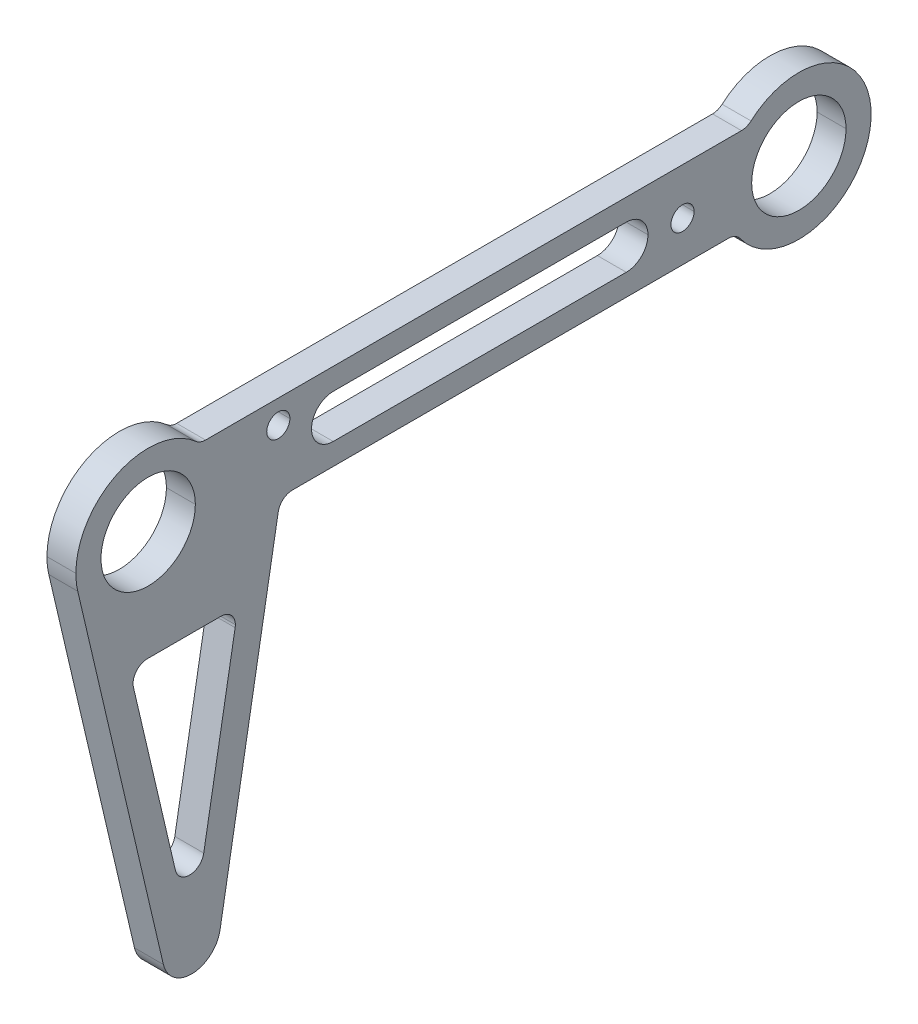
ISO-10303-21;
HEADER;
FILE_DESCRIPTION(('STEP AP214'),'2;1');
FILE_NAME('part.step','',(''),(''),'','','');
FILE_SCHEMA(('AUTOMOTIVE_DESIGN { 1 0 10303 214 1 1 1 1 }'));
ENDSEC;
DATA;
#1=APPLICATION_CONTEXT('core data for automotive mechanical design processes');
#2=APPLICATION_PROTOCOL_DEFINITION('international standard','automotive_design',2000,#1);
#3=PRODUCT_CONTEXT('',#1,'mechanical');
#4=PRODUCT('Part','Part','',(#3));
#5=PRODUCT_RELATED_PRODUCT_CATEGORY('part','',(#4));
#6=PRODUCT_DEFINITION_FORMATION('','',#4);
#7=PRODUCT_DEFINITION_CONTEXT('part definition',#1,'design');
#8=PRODUCT_DEFINITION('design','',#6,#7);
#9=PRODUCT_DEFINITION_SHAPE('','',#8);
#10=(LENGTH_UNIT() NAMED_UNIT(*) SI_UNIT(.MILLI.,.METRE.));
#11=(NAMED_UNIT(*) PLANE_ANGLE_UNIT() SI_UNIT($,.RADIAN.));
#12=(NAMED_UNIT(*) SI_UNIT($,.STERADIAN.) SOLID_ANGLE_UNIT());
#13=UNCERTAINTY_MEASURE_WITH_UNIT(LENGTH_MEASURE(1.E-05),#10,'distance_accuracy_value','');
#14=(GEOMETRIC_REPRESENTATION_CONTEXT(3) GLOBAL_UNCERTAINTY_ASSIGNED_CONTEXT((#13)) GLOBAL_UNIT_ASSIGNED_CONTEXT((#10,
#11,#12)) REPRESENTATION_CONTEXT('',''));
#15=CARTESIAN_POINT('',(0.,0.,0.));
#16=DIRECTION('',(0.,0.,1.));
#17=DIRECTION('',(1.,0.,0.));
#18=AXIS2_PLACEMENT_3D('',#15,#16,#17);
#19=CARTESIAN_POINT('',(-6.,-2.,-25.5960877099638));
#20=DIRECTION('',(0.,-1.,0.));
#21=DIRECTION('',(0.,0.,-1.));
#22=AXIS2_PLACEMENT_3D('',#19,#20,#21);
#23=PLANE('',#22);
#24=DIRECTION('',(1.,0.,0.));
#25=VECTOR('',#24,1.);
#26=CARTESIAN_POINT('',(-6.,-2.,-25.5960877099638));
#27=LINE('',#26,#25);
#28=CARTESIAN_POINT('',(0.,-2.,-25.5960877099638));
#29=VERTEX_POINT('',#28);
#30=CARTESIAN_POINT('',(4.,-2.,-25.5960877099638));
#31=VERTEX_POINT('',#30);
#32=EDGE_CURVE('E25',#29,#31,#27,.T.);
#33=ORIENTED_EDGE('',*,*,#32,.T.);
#34=DIRECTION('',(0.,0.,-1.));
#35=VECTOR('',#34,1.);
#36=CARTESIAN_POINT('',(4.,-2.,-25.5960877099638));
#37=LINE('',#36,#35);
#38=CARTESIAN_POINT('',(4.,-2.,-66.128704493595));
#39=VERTEX_POINT('',#38);
#40=EDGE_CURVE('E414',#31,#39,#37,.T.);
#41=ORIENTED_EDGE('',*,*,#40,.T.);
#42=DIRECTION('',(1.,0.,0.));
#43=VECTOR('',#42,1.);
#44=CARTESIAN_POINT('',(-6.,-2.,-66.128704493595));
#45=LINE('',#44,#43);
#46=CARTESIAN_POINT('',(0.,-2.,-66.128704493595));
#47=VERTEX_POINT('',#46);
#48=EDGE_CURVE('E11',#47,#39,#45,.T.);
#49=ORIENTED_EDGE('',*,*,#48,.F.);
#50=DIRECTION('',(0.,0.,-1.));
#51=VECTOR('',#50,1.);
#52=CARTESIAN_POINT('',(0.,-2.,0.));
#53=LINE('',#52,#51);
#54=EDGE_CURVE('E418',#29,#47,#53,.T.);
#55=ORIENTED_EDGE('',*,*,#54,.F.);
#56=EDGE_LOOP('',(#33,#41,#49,#55));
#57=FACE_BOUND('',#56,.T.);
#58=ADVANCED_FACE('F17',(#57),#23,.F.);
#59=CARTESIAN_POINT('',(-6.,1.,-66.128704493595));
#60=DIRECTION('',(1.,0.,0.));
#61=DIRECTION('',(0.,0.,-1.));
#62=AXIS2_PLACEMENT_3D('',#59,#60,#61);
#63=CYLINDRICAL_SURFACE('',#62,3.);
#64=DIRECTION('',(1.,0.,0.));
#65=VECTOR('',#64,1.);
#66=CARTESIAN_POINT('',(-6.,1.,-69.128704493595));
#67=LINE('',#66,#65);
#68=CARTESIAN_POINT('',(0.,1.,-69.128704493595));
#69=VERTEX_POINT('',#68);
#70=CARTESIAN_POINT('',(4.,1.,-69.128704493595));
#71=VERTEX_POINT('',#70);
#72=EDGE_CURVE('E1470',#69,#71,#67,.T.);
#73=ORIENTED_EDGE('',*,*,#72,.F.);
#74=CARTESIAN_POINT('',(0.,1.,-66.128704493595));
#75=DIRECTION('',(1.,0.,0.));
#76=DIRECTION('',(0.,0.,-1.));
#77=AXIS2_PLACEMENT_3D('',#74,#75,#76);
#78=CIRCLE('',#77,3.);
#79=EDGE_CURVE('E422',#47,#69,#78,.T.);
#80=ORIENTED_EDGE('',*,*,#79,.F.);
#81=ORIENTED_EDGE('',*,*,#48,.T.);
#82=CARTESIAN_POINT('',(4.,1.,-66.128704493595));
#83=DIRECTION('',(1.,0.,0.));
#84=DIRECTION('',(0.,0.,-1.));
#85=AXIS2_PLACEMENT_3D('',#82,#83,#84);
#86=CIRCLE('',#85,3.);
#87=EDGE_CURVE('E362',#39,#71,#86,.T.);
#88=ORIENTED_EDGE('',*,*,#87,.T.);
#89=EDGE_LOOP('',(#73,#80,#81,#88));
#90=FACE_BOUND('',#89,.T.);
#91=ADVANCED_FACE('F1087',(#90),#63,.F.);
#92=CARTESIAN_POINT('',(-6.,4.,-25.5960877099638));
#93=DIRECTION('',(0.,1.,0.));
#94=DIRECTION('',(1.,0.,0.));
#95=AXIS2_PLACEMENT_3D('',#92,#93,#94);
#96=PLANE('',#95);
#97=DIRECTION('',(1.,0.,0.));
#98=VECTOR('',#97,1.);
#99=CARTESIAN_POINT('',(-6.,4.,-66.128704493595));
#100=LINE('',#99,#98);
#101=CARTESIAN_POINT('',(0.,4.,-66.128704493595));
#102=VERTEX_POINT('',#101);
#103=CARTESIAN_POINT('',(4.,4.,-66.128704493595));
#104=VERTEX_POINT('',#103);
#105=EDGE_CURVE('E1482',#102,#104,#100,.T.);
#106=ORIENTED_EDGE('',*,*,#105,.T.);
#107=DIRECTION('',(0.,0.,1.));
#108=VECTOR('',#107,1.);
#109=CARTESIAN_POINT('',(4.,4.,-25.5960877099638));
#110=LINE('',#109,#108);
#111=CARTESIAN_POINT('',(4.,4.,-25.5960877099638));
#112=VERTEX_POINT('',#111);
#113=EDGE_CURVE('E358',#104,#112,#110,.T.);
#114=ORIENTED_EDGE('',*,*,#113,.T.);
#115=DIRECTION('',(1.,0.,0.));
#116=VECTOR('',#115,1.);
#117=CARTESIAN_POINT('',(-6.,4.,-25.5960877099638));
#118=LINE('',#117,#116);
#119=CARTESIAN_POINT('',(0.,4.,-25.5960877099638));
#120=VERTEX_POINT('',#119);
#121=EDGE_CURVE('E523',#120,#112,#118,.T.);
#122=ORIENTED_EDGE('',*,*,#121,.F.);
#123=DIRECTION('',(0.,0.,1.));
#124=VECTOR('',#123,1.);
#125=CARTESIAN_POINT('',(0.,4.,0.));
#126=LINE('',#125,#124);
#127=EDGE_CURVE('E312',#102,#120,#126,.T.);
#128=ORIENTED_EDGE('',*,*,#127,.F.);
#129=EDGE_LOOP('',(#106,#114,#122,#128));
#130=FACE_BOUND('',#129,.T.);
#131=ADVANCED_FACE('F864',(#130),#96,.F.);
#132=CARTESIAN_POINT('',(-6.,1.,-25.5960877099638));
#133=DIRECTION('',(1.,0.,0.));
#134=DIRECTION('',(0.,0.,-1.));
#135=AXIS2_PLACEMENT_3D('',#132,#133,#134);
#136=CYLINDRICAL_SURFACE('',#135,3.);
#137=ORIENTED_EDGE('',*,*,#121,.T.);
#138=CARTESIAN_POINT('',(4.,1.,-25.5960877099638));
#139=DIRECTION('',(1.,0.,0.));
#140=DIRECTION('',(0.,0.,-1.));
#141=AXIS2_PLACEMENT_3D('',#138,#139,#140);
#142=CIRCLE('',#141,3.);
#143=EDGE_CURVE('E363',#112,#31,#142,.T.);
#144=ORIENTED_EDGE('',*,*,#143,.T.);
#145=ORIENTED_EDGE('',*,*,#32,.F.);
#146=CARTESIAN_POINT('',(0.,1.,-25.5960877099638));
#147=DIRECTION('',(1.,0.,0.));
#148=DIRECTION('',(0.,0.,-1.));
#149=AXIS2_PLACEMENT_3D('',#146,#147,#148);
#150=CIRCLE('',#149,3.);
#151=EDGE_CURVE('E423',#120,#29,#150,.T.);
#152=ORIENTED_EDGE('',*,*,#151,.F.);
#153=EDGE_LOOP('',(#137,#144,#145,#152));
#154=FACE_BOUND('',#153,.T.);
#155=ADVANCED_FACE('F860',(#154),#136,.F.);
#156=CARTESIAN_POINT('',(4.,-7.,-19.9579703985189));
#157=DIRECTION('',(1.,0.,0.));
#158=DIRECTION('',(0.,0.,-1.));
#159=AXIS2_PLACEMENT_3D('',#156,#157,#158);
#160=CYLINDRICAL_SURFACE('',#159,2.);
#161=CARTESIAN_POINT('',(0.,-7.,-19.9579703985189));
#162=DIRECTION('',(1.,0.,0.));
#163=DIRECTION('',(0.,0.,-1.));
#164=AXIS2_PLACEMENT_3D('',#161,#162,#163);
#165=CIRCLE('',#164,2.);
#166=CARTESIAN_POINT('',(0.,-5.,-19.9579703985189));
#167=VERTEX_POINT('',#166);
#168=CARTESIAN_POINT('',(0.,-6.65558033936127,-17.9878498191214));
#169=VERTEX_POINT('',#168);
#170=EDGE_CURVE('E451',#167,#169,#165,.T.);
#171=ORIENTED_EDGE('',*,*,#170,.F.);
#172=DIRECTION('',(-1.,0.,0.));
#173=VECTOR('',#172,1.);
#174=CARTESIAN_POINT('',(-6.,-5.,-19.9579703985189));
#175=LINE('',#174,#173);
#176=CARTESIAN_POINT('',(4.,-5.,-19.9579703985189));
#177=VERTEX_POINT('',#176);
#178=EDGE_CURVE('E377',#177,#167,#175,.T.);
#179=ORIENTED_EDGE('',*,*,#178,.F.);
#180=CARTESIAN_POINT('',(4.,-7.,-19.9579703985189));
#181=DIRECTION('',(-1.,0.,0.));
#182=DIRECTION('',(0.,0.,-1.));
#183=AXIS2_PLACEMENT_3D('',#180,#181,#182);
#184=CIRCLE('',#183,2.);
#185=CARTESIAN_POINT('',(4.,-6.65558033936127,-17.9878498191214));
#186=VERTEX_POINT('',#185);
#187=EDGE_CURVE('E390',#186,#177,#184,.T.);
#188=ORIENTED_EDGE('',*,*,#187,.F.);
#189=DIRECTION('',(1.,0.,0.));
#190=VECTOR('',#189,1.);
#191=CARTESIAN_POINT('',(4.,-6.65558033936127,-17.9878498191214));
#192=LINE('',#191,#190);
#193=EDGE_CURVE('E505',#169,#186,#192,.T.);
#194=ORIENTED_EDGE('',*,*,#193,.F.);
#195=EDGE_LOOP('',(#171,#179,#188,#194));
#196=FACE_BOUND('',#195,.T.);
#197=ADVANCED_FACE('F652',(#196),#160,.F.);
#198=CARTESIAN_POINT('',(4.,-17.1742889234771,-10.0579544592766));
#199=DIRECTION('',(1.,0.,0.));
#200=DIRECTION('',(0.,0.,-1.));
#201=AXIS2_PLACEMENT_3D('',#198,#199,#200);
#202=CYLINDRICAL_SURFACE('',#201,2.);
#203=DIRECTION('',(1.,0.,0.));
#204=VECTOR('',#203,1.);
#205=CARTESIAN_POINT('',(4.,-17.1742889234771,-12.0579544592766));
#206=LINE('',#205,#204);
#207=CARTESIAN_POINT('',(0.,-17.1742889234771,-12.0579544592766));
#208=VERTEX_POINT('',#207);
#209=CARTESIAN_POINT('',(4.,-17.1742889234771,-12.0579544592766));
#210=VERTEX_POINT('',#209);
#211=EDGE_CURVE('E1509',#208,#210,#206,.T.);
#212=ORIENTED_EDGE('',*,*,#211,.F.);
#213=CARTESIAN_POINT('',(0.,-17.1742889234771,-10.0579544592766));
#214=DIRECTION('',(1.,0.,0.));
#215=DIRECTION('',(0.,0.,-1.));
#216=AXIS2_PLACEMENT_3D('',#213,#214,#215);
#217=CIRCLE('',#216,2.);
#218=CARTESIAN_POINT('',(0.,-17.5187085841158,-12.0280750386741));
#219=VERTEX_POINT('',#218);
#220=EDGE_CURVE('E399',#219,#208,#217,.T.);
#221=ORIENTED_EDGE('',*,*,#220,.F.);
#222=DIRECTION('',(-1.,0.,0.));
#223=VECTOR('',#222,1.);
#224=CARTESIAN_POINT('',(0.,-17.5187085841158,-12.0280750386741));
#225=LINE('',#224,#223);
#226=CARTESIAN_POINT('',(4.,-17.5187085841158,-12.0280750386741));
#227=VERTEX_POINT('',#226);
#228=EDGE_CURVE('E475',#227,#219,#225,.T.);
#229=ORIENTED_EDGE('',*,*,#228,.F.);
#230=CARTESIAN_POINT('',(4.,-17.1742889234771,-10.0579544592766));
#231=DIRECTION('',(-1.,0.,0.));
#232=DIRECTION('',(0.,0.,-1.));
#233=AXIS2_PLACEMENT_3D('',#230,#231,#232);
#234=CIRCLE('',#233,2.);
#235=EDGE_CURVE('E353',#210,#227,#234,.T.);
#236=ORIENTED_EDGE('',*,*,#235,.F.);
#237=EDGE_LOOP('',(#212,#221,#229,#236));
#238=FACE_BOUND('',#237,.T.);
#239=ADVANCED_FACE('F1064',(#238),#202,.F.);
#240=CARTESIAN_POINT('',(4.,-17.1742889234771,0.0911708065031039));
#241=DIRECTION('',(1.,0.,0.));
#242=DIRECTION('',(0.,0.,-1.));
#243=AXIS2_PLACEMENT_3D('',#240,#241,#242);
#244=CYLINDRICAL_SURFACE('',#243,2.);
#245=CARTESIAN_POINT('',(4.,-17.1742889234771,0.0911708065031039));
#246=DIRECTION('',(-1.,0.,0.));
#247=DIRECTION('',(0.,0.,-1.));
#248=AXIS2_PLACEMENT_3D('',#245,#246,#247);
#249=CIRCLE('',#248,2.);
#250=CARTESIAN_POINT('',(4.,-17.6297633760318,2.03861606197755));
#251=VERTEX_POINT('',#250);
#252=CARTESIAN_POINT('',(4.,-15.1742889234772,0.0911708065031037));
#253=VERTEX_POINT('',#252);
#254=EDGE_CURVE('E441',#251,#253,#249,.T.);
#255=ORIENTED_EDGE('',*,*,#254,.F.);
#256=DIRECTION('',(1.,0.,0.));
#257=VECTOR('',#256,1.);
#258=CARTESIAN_POINT('',(4.,-17.6297633760319,2.03861606197755));
#259=LINE('',#258,#257);
#260=CARTESIAN_POINT('',(0.,-17.6297633760318,2.03861606197755));
#261=VERTEX_POINT('',#260);
#262=EDGE_CURVE('E49',#261,#251,#259,.T.);
#263=ORIENTED_EDGE('',*,*,#262,.F.);
#264=CARTESIAN_POINT('',(0.,-17.1742889234771,0.0911708065031039));
#265=DIRECTION('',(1.,0.,0.));
#266=DIRECTION('',(0.,0.,-1.));
#267=AXIS2_PLACEMENT_3D('',#264,#265,#266);
#268=CIRCLE('',#267,2.);
#269=CARTESIAN_POINT('',(0.,-15.1742889234772,0.0911708065031037));
#270=VERTEX_POINT('',#269);
#271=EDGE_CURVE('E482',#270,#261,#268,.T.);
#272=ORIENTED_EDGE('',*,*,#271,.F.);
#273=DIRECTION('',(-1.,0.,0.));
#274=VECTOR('',#273,1.);
#275=CARTESIAN_POINT('',(0.,-15.1742889234772,0.0911708065031037));
#276=LINE('',#275,#274);
#277=EDGE_CURVE('E508',#253,#270,#276,.T.);
#278=ORIENTED_EDGE('',*,*,#277,.F.);
#279=EDGE_LOOP('',(#255,#263,#272,#278));
#280=FACE_BOUND('',#279,.T.);
#281=ADVANCED_FACE('F1055',(#280),#244,.F.);
#282=CARTESIAN_POINT('',(4.,-42.0067068883339,-5.71671105634195));
#283=DIRECTION('',(1.,0.,0.));
#284=DIRECTION('',(0.,0.,-1.));
#285=AXIS2_PLACEMENT_3D('',#282,#283,#284);
#286=CYLINDRICAL_SURFACE('',#285,2.);
#287=CARTESIAN_POINT('',(4.,-42.0067068883339,-5.71671105634195));
#288=DIRECTION('',(-1.,0.,0.));
#289=DIRECTION('',(0.,0.,-1.));
#290=AXIS2_PLACEMENT_3D('',#287,#288,#289);
#291=CIRCLE('',#290,2.);
#292=CARTESIAN_POINT('',(4.,-42.3511265489726,-7.68683163573943));
#293=VERTEX_POINT('',#292);
#294=CARTESIAN_POINT('',(4.,-42.4621813408885,-3.7692658008675));
#295=VERTEX_POINT('',#294);
#296=EDGE_CURVE('E431',#293,#295,#291,.T.);
#297=ORIENTED_EDGE('',*,*,#296,.F.);
#298=DIRECTION('',(1.,0.,0.));
#299=VECTOR('',#298,1.);
#300=CARTESIAN_POINT('',(4.,-42.3511265489726,-7.68683163573943));
#301=LINE('',#300,#299);
#302=CARTESIAN_POINT('',(0.,-42.3511265489726,-7.68683163573943));
#303=VERTEX_POINT('',#302);
#304=EDGE_CURVE('E472',#303,#293,#301,.T.);
#305=ORIENTED_EDGE('',*,*,#304,.F.);
#306=CARTESIAN_POINT('',(0.,-42.0067068883339,-5.71671105634195));
#307=DIRECTION('',(1.,0.,0.));
#308=DIRECTION('',(0.,0.,-1.));
#309=AXIS2_PLACEMENT_3D('',#306,#307,#308);
#310=CIRCLE('',#309,2.);
#311=CARTESIAN_POINT('',(0.,-42.4621813408885,-3.7692658008675));
#312=VERTEX_POINT('',#311);
#313=EDGE_CURVE('E487',#312,#303,#310,.T.);
#314=ORIENTED_EDGE('',*,*,#313,.F.);
#315=DIRECTION('',(-1.,0.,0.));
#316=VECTOR('',#315,1.);
#317=CARTESIAN_POINT('',(0.,-42.4621813408885,-3.7692658008675));
#318=LINE('',#317,#316);
#319=EDGE_CURVE('E38',#295,#312,#318,.T.);
#320=ORIENTED_EDGE('',*,*,#319,.F.);
#321=EDGE_LOOP('',(#297,#305,#314,#320));
#322=FACE_BOUND('',#321,.T.);
#323=ADVANCED_FACE('F1047',(#322),#286,.F.);
#324=CARTESIAN_POINT('',(4.,9.,-82.0627460668062));
#325=DIRECTION('',(-1.,0.,0.));
#326=DIRECTION('',(0.,0.,1.));
#327=AXIS2_PLACEMENT_3D('',#324,#325,#326);
#328=CYLINDRICAL_SURFACE('',#327,2.);
#329=CARTESIAN_POINT('',(0.,9.,-82.0627460668062));
#330=DIRECTION('',(1.,0.,0.));
#331=DIRECTION('',(0.,0.,-1.));
#332=AXIS2_PLACEMENT_3D('',#329,#330,#331);
#333=CIRCLE('',#332,2.);
#334=CARTESIAN_POINT('',(0.,7.,-82.0627460668062));
#335=VERTEX_POINT('',#334);
#336=CARTESIAN_POINT('',(0.,7.5,-83.3856217223385));
#337=VERTEX_POINT('',#336);
#338=EDGE_CURVE('E344',#335,#337,#333,.T.);
#339=ORIENTED_EDGE('',*,*,#338,.F.);
#340=DIRECTION('',(-1.,0.,0.));
#341=VECTOR('',#340,1.);
#342=CARTESIAN_POINT('',(0.,7.,-82.0627460668062));
#343=LINE('',#342,#341);
#344=CARTESIAN_POINT('',(4.,7.,-82.0627460668062));
#345=VERTEX_POINT('',#344);
#346=EDGE_CURVE('E521',#345,#335,#343,.T.);
#347=ORIENTED_EDGE('',*,*,#346,.F.);
#348=CARTESIAN_POINT('',(4.,9.,-82.0627460668062));
#349=DIRECTION('',(-1.,0.,0.));
#350=DIRECTION('',(0.,0.,-1.));
#351=AXIS2_PLACEMENT_3D('',#348,#349,#350);
#352=CIRCLE('',#351,2.);
#353=CARTESIAN_POINT('',(4.,7.5,-83.3856217223385));
#354=VERTEX_POINT('',#353);
#355=EDGE_CURVE('E364',#354,#345,#352,.T.);
#356=ORIENTED_EDGE('',*,*,#355,.F.);
#357=DIRECTION('',(1.,0.,0.));
#358=VECTOR('',#357,1.);
#359=CARTESIAN_POINT('',(4.,7.5,-83.3856217223385));
#360=LINE('',#359,#358);
#361=EDGE_CURVE('E514',#337,#354,#360,.T.);
#362=ORIENTED_EDGE('',*,*,#361,.F.);
#363=EDGE_LOOP('',(#339,#347,#356,#362));
#364=FACE_BOUND('',#363,.T.);
#365=ADVANCED_FACE('F636',(#364),#328,.F.);
#366=CARTESIAN_POINT('',(4.,-7.,-80.253205655191));
#367=DIRECTION('',(-1.,0.,0.));
#368=DIRECTION('',(0.,0.,1.));
#369=AXIS2_PLACEMENT_3D('',#366,#367,#368);
#370=CYLINDRICAL_SURFACE('',#369,2.);
#371=CARTESIAN_POINT('',(0.,-7.,-80.253205655191));
#372=DIRECTION('',(1.,0.,0.));
#373=DIRECTION('',(0.,0.,-1.));
#374=AXIS2_PLACEMENT_3D('',#371,#372,#373);
#375=CIRCLE('',#374,2.);
#376=CARTESIAN_POINT('',(0.,-5.83333333333333,-81.8776713793259));
#377=VERTEX_POINT('',#376);
#378=CARTESIAN_POINT('',(0.,-5.,-80.253205655191));
#379=VERTEX_POINT('',#378);
#380=EDGE_CURVE('E391',#377,#379,#375,.T.);
#381=ORIENTED_EDGE('',*,*,#380,.F.);
#382=DIRECTION('',(-1.,0.,0.));
#383=VECTOR('',#382,1.);
#384=CARTESIAN_POINT('',(4.,-5.83333333333333,-81.8776713793259));
#385=LINE('',#384,#383);
#386=CARTESIAN_POINT('',(4.,-5.83333333333333,-81.8776713793259));
#387=VERTEX_POINT('',#386);
#388=EDGE_CURVE('E511',#387,#377,#385,.T.);
#389=ORIENTED_EDGE('',*,*,#388,.F.);
#390=CARTESIAN_POINT('',(4.,-7.,-80.253205655191));
#391=DIRECTION('',(-1.,0.,0.));
#392=DIRECTION('',(0.,0.,-1.));
#393=AXIS2_PLACEMENT_3D('',#390,#391,#392);
#394=CIRCLE('',#393,2.);
#395=CARTESIAN_POINT('',(4.,-5.,-80.253205655191));
#396=VERTEX_POINT('',#395);
#397=EDGE_CURVE('E343',#396,#387,#394,.T.);
#398=ORIENTED_EDGE('',*,*,#397,.F.);
#399=DIRECTION('',(1.,0.,0.));
#400=VECTOR('',#399,1.);
#401=CARTESIAN_POINT('',(-6.,-5.,-80.253205655191));
#402=LINE('',#401,#400);
#403=EDGE_CURVE('E381',#379,#396,#402,.T.);
#404=ORIENTED_EDGE('',*,*,#403,.F.);
#405=EDGE_LOOP('',(#381,#389,#398,#404));
#406=FACE_BOUND('',#405,.T.);
#407=ADVANCED_FACE('F646',(#406),#370,.F.);
#408=CARTESIAN_POINT('',(4.,9.,-7.93725393319377));
#409=DIRECTION('',(-1.,0.,0.));
#410=DIRECTION('',(0.,0.,1.));
#411=AXIS2_PLACEMENT_3D('',#408,#409,#410);
#412=CYLINDRICAL_SURFACE('',#411,2.);
#413=CARTESIAN_POINT('',(0.,9.,-7.93725393319377));
#414=DIRECTION('',(1.,0.,0.));
#415=DIRECTION('',(0.,0.,-1.));
#416=AXIS2_PLACEMENT_3D('',#413,#414,#415);
#417=CIRCLE('',#416,2.);
#418=CARTESIAN_POINT('',(0.,7.5,-6.61437827766148));
#419=VERTEX_POINT('',#418);
#420=CARTESIAN_POINT('',(0.,7.,-7.93725393319377));
#421=VERTEX_POINT('',#420);
#422=EDGE_CURVE('E410',#419,#421,#417,.T.);
#423=ORIENTED_EDGE('',*,*,#422,.F.);
#424=DIRECTION('',(-1.,0.,0.));
#425=VECTOR('',#424,1.);
#426=CARTESIAN_POINT('',(4.,7.5,-6.61437827766148));
#427=LINE('',#426,#425);
#428=CARTESIAN_POINT('',(4.,7.5,-6.61437827766148));
#429=VERTEX_POINT('',#428);
#430=EDGE_CURVE('E498',#429,#419,#427,.T.);
#431=ORIENTED_EDGE('',*,*,#430,.F.);
#432=CARTESIAN_POINT('',(4.,9.,-7.93725393319377));
#433=DIRECTION('',(-1.,0.,0.));
#434=DIRECTION('',(0.,0.,-1.));
#435=AXIS2_PLACEMENT_3D('',#432,#433,#434);
#436=CIRCLE('',#435,2.);
#437=CARTESIAN_POINT('',(4.,7.,-7.93725393319377));
#438=VERTEX_POINT('',#437);
#439=EDGE_CURVE('E372',#438,#429,#436,.T.);
#440=ORIENTED_EDGE('',*,*,#439,.F.);
#441=DIRECTION('',(1.,0.,0.));
#442=VECTOR('',#441,1.);
#443=CARTESIAN_POINT('',(4.,7.,-7.93725393319377));
#444=LINE('',#443,#442);
#445=EDGE_CURVE('E380',#421,#438,#444,.T.);
#446=ORIENTED_EDGE('',*,*,#445,.F.);
#447=EDGE_LOOP('',(#423,#431,#440,#446));
#448=FACE_BOUND('',#447,.T.);
#449=ADVANCED_FACE('F630',(#448),#412,.F.);
#450=CARTESIAN_POINT('',(-6.,7.,0.));
#451=DIRECTION('',(0.,-1.,0.));
#452=DIRECTION('',(0.,0.,-1.));
#453=AXIS2_PLACEMENT_3D('',#450,#451,#452);
#454=PLANE('',#453);
#455=DIRECTION('',(0.,0.,-1.));
#456=VECTOR('',#455,1.);
#457=CARTESIAN_POINT('',(0.,7.,0.));
#458=LINE('',#457,#456);
#459=EDGE_CURVE('E349',#421,#335,#458,.T.);
#460=ORIENTED_EDGE('',*,*,#459,.F.);
#461=ORIENTED_EDGE('',*,*,#445,.T.);
#462=DIRECTION('',(0.,0.,-1.));
#463=VECTOR('',#462,1.);
#464=CARTESIAN_POINT('',(4.,7.,0.));
#465=LINE('',#464,#463);
#466=EDGE_CURVE('E368',#438,#345,#465,.T.);
#467=ORIENTED_EDGE('',*,*,#466,.T.);
#468=ORIENTED_EDGE('',*,*,#346,.T.);
#469=EDGE_LOOP('',(#460,#461,#467,#468));
#470=FACE_BOUND('',#469,.T.);
#471=ADVANCED_FACE('F632',(#470),#454,.F.);
#472=CARTESIAN_POINT('',(-6.,-5.,0.));
#473=DIRECTION('',(0.,-1.,0.));
#474=DIRECTION('',(-1.,0.,0.));
#475=AXIS2_PLACEMENT_3D('',#472,#473,#474);
#476=PLANE('',#475);
#477=DIRECTION('',(0.,0.,-1.));
#478=VECTOR('',#477,1.);
#479=CARTESIAN_POINT('',(0.,-5.,0.));
#480=LINE('',#479,#478);
#481=EDGE_CURVE('E395',#167,#379,#480,.T.);
#482=ORIENTED_EDGE('',*,*,#481,.T.);
#483=ORIENTED_EDGE('',*,*,#403,.T.);
#484=DIRECTION('',(0.,0.,-1.));
#485=VECTOR('',#484,1.);
#486=CARTESIAN_POINT('',(4.,-5.,0.));
#487=LINE('',#486,#485);
#488=EDGE_CURVE('E323',#177,#396,#487,.T.);
#489=ORIENTED_EDGE('',*,*,#488,.F.);
#490=ORIENTED_EDGE('',*,*,#178,.T.);
#491=EDGE_LOOP('',(#482,#483,#489,#490));
#492=FACE_BOUND('',#491,.T.);
#493=ADVANCED_FACE('F649',(#492),#476,.T.);
#494=CARTESIAN_POINT('',(4.,0.597056517699689,-73.9113397425372));
#495=DIRECTION('',(-1.,0.,0.));
#496=DIRECTION('',(0.,0.,1.));
#497=AXIS2_PLACEMENT_3D('',#494,#495,#496);
#498=CYLINDRICAL_SURFACE('',#497,1.6);
#499=DIRECTION('',(-1.,0.,0.));
#500=VECTOR('',#499,1.);
#501=CARTESIAN_POINT('',(4.,0.597056517699689,-75.5113397425372));
#502=LINE('',#501,#500);
#503=CARTESIAN_POINT('',(4.,0.597056517699689,-75.5113397425372));
#504=VERTEX_POINT('',#503);
#505=CARTESIAN_POINT('',(0.,0.597056517699689,-75.5113397425372));
#506=VERTEX_POINT('',#505);
#507=EDGE_CURVE('E543',#504,#506,#502,.T.);
#508=ORIENTED_EDGE('',*,*,#507,.F.);
#509=CARTESIAN_POINT('',(4.,0.597056517699689,-73.9113397425372));
#510=DIRECTION('',(1.,0.,0.));
#511=DIRECTION('',(0.,0.,-1.));
#512=AXIS2_PLACEMENT_3D('',#509,#510,#511);
#513=CIRCLE('',#512,1.6);
#514=CARTESIAN_POINT('',(4.,0.597056517699689,-72.3113397425372));
#515=VERTEX_POINT('',#514);
#516=EDGE_CURVE('E411',#504,#515,#513,.T.);
#517=ORIENTED_EDGE('',*,*,#516,.T.);
#518=DIRECTION('',(-1.,0.,0.));
#519=VECTOR('',#518,1.);
#520=CARTESIAN_POINT('',(4.,0.597056517699689,-72.3113397425372));
#521=LINE('',#520,#519);
#522=CARTESIAN_POINT('',(0.,0.597056517699689,-72.3113397425372));
#523=VERTEX_POINT('',#522);
#524=EDGE_CURVE('E552',#515,#523,#521,.T.);
#525=ORIENTED_EDGE('',*,*,#524,.T.);
#526=CARTESIAN_POINT('',(0.,0.597056517699689,-73.9113397425372));
#527=DIRECTION('',(1.,0.,0.));
#528=DIRECTION('',(0.,0.,-1.));
#529=AXIS2_PLACEMENT_3D('',#526,#527,#528);
#530=CIRCLE('',#529,1.6);
#531=EDGE_CURVE('E476',#506,#523,#530,.T.);
#532=ORIENTED_EDGE('',*,*,#531,.F.);
#533=EDGE_LOOP('',(#508,#517,#525,#532));
#534=FACE_BOUND('',#533,.T.);
#535=ADVANCED_FACE('F1010',(#534),#498,.F.);
#536=CARTESIAN_POINT('',(4.,0.,-90.));
#537=DIRECTION('',(-1.,0.,0.));
#538=DIRECTION('',(0.,0.,1.));
#539=AXIS2_PLACEMENT_3D('',#536,#537,#538);
#540=CYLINDRICAL_SURFACE('',#539,10.);
#541=CARTESIAN_POINT('',(4.,0.,-90.));
#542=DIRECTION('',(1.,0.,0.));
#543=DIRECTION('',(0.,0.,-1.));
#544=AXIS2_PLACEMENT_3D('',#541,#542,#543);
#545=CIRCLE('',#544,10.);
#546=EDGE_CURVE('E337',#387,#354,#545,.T.);
#547=ORIENTED_EDGE('',*,*,#546,.F.);
#548=ORIENTED_EDGE('',*,*,#388,.T.);
#549=CARTESIAN_POINT('',(0.,0.,-90.));
#550=DIRECTION('',(1.,0.,0.));
#551=DIRECTION('',(0.,0.,-1.));
#552=AXIS2_PLACEMENT_3D('',#549,#550,#551);
#553=CIRCLE('',#552,10.);
#554=EDGE_CURVE('E348',#377,#337,#553,.T.);
#555=ORIENTED_EDGE('',*,*,#554,.T.);
#556=ORIENTED_EDGE('',*,*,#361,.T.);
#557=EDGE_LOOP('',(#547,#548,#555,#556));
#558=FACE_BOUND('',#557,.T.);
#559=ADVANCED_FACE('F642',(#558),#540,.T.);
#560=CARTESIAN_POINT('',(4.,0.,0.));
#561=DIRECTION('',(-1.,0.,0.));
#562=DIRECTION('',(0.,0.,1.));
#563=AXIS2_PLACEMENT_3D('',#560,#561,#562);
#564=CYLINDRICAL_SURFACE('',#563,6.525);
#565=DIRECTION('',(-1.,0.,0.));
#566=VECTOR('',#565,1.);
#567=CARTESIAN_POINT('',(4.,0.,-6.525));
#568=LINE('',#567,#566);
#569=CARTESIAN_POINT('',(4.,0.,-6.525));
#570=VERTEX_POINT('',#569);
#571=CARTESIAN_POINT('',(0.,0.,-6.525));
#572=VERTEX_POINT('',#571);
#573=EDGE_CURVE('E551',#570,#572,#568,.T.);
#574=ORIENTED_EDGE('',*,*,#573,.F.);
#575=CARTESIAN_POINT('',(4.,0.,0.));
#576=DIRECTION('',(1.,0.,0.));
#577=DIRECTION('',(0.,0.,-1.));
#578=AXIS2_PLACEMENT_3D('',#575,#576,#577);
#579=CIRCLE('',#578,6.525);
#580=CARTESIAN_POINT('',(4.,0.,6.525));
#581=VERTEX_POINT('',#580);
#582=EDGE_CURVE('E415',#570,#581,#579,.T.);
#583=ORIENTED_EDGE('',*,*,#582,.T.);
#584=DIRECTION('',(-1.,0.,0.));
#585=VECTOR('',#584,1.);
#586=CARTESIAN_POINT('',(4.,0.,6.525));
#587=LINE('',#586,#585);
#588=CARTESIAN_POINT('',(0.,0.,6.525));
#589=VERTEX_POINT('',#588);
#590=EDGE_CURVE('E580',#581,#589,#587,.T.);
#591=ORIENTED_EDGE('',*,*,#590,.T.);
#592=CARTESIAN_POINT('',(0.,0.,0.));
#593=DIRECTION('',(1.,0.,0.));
#594=DIRECTION('',(0.,0.,-1.));
#595=AXIS2_PLACEMENT_3D('',#592,#593,#594);
#596=CIRCLE('',#595,6.525);
#597=EDGE_CURVE('E461',#572,#589,#596,.T.);
#598=ORIENTED_EDGE('',*,*,#597,.F.);
#599=EDGE_LOOP('',(#574,#583,#591,#598));
#600=FACE_BOUND('',#599,.T.);
#601=ADVANCED_FACE('F993',(#600),#564,.F.);
#602=CARTESIAN_POINT('',(4.,3.74699115108206,-18.));
#603=DIRECTION('',(-1.,0.,0.));
#604=DIRECTION('',(0.,0.,1.));
#605=AXIS2_PLACEMENT_3D('',#602,#603,#604);
#606=CYLINDRICAL_SURFACE('',#605,1.6);
#607=DIRECTION('',(-1.,0.,0.));
#608=VECTOR('',#607,1.);
#609=CARTESIAN_POINT('',(4.,3.74699115108206,-19.6));
#610=LINE('',#609,#608);
#611=CARTESIAN_POINT('',(4.,3.74699115108206,-19.6));
#612=VERTEX_POINT('',#611);
#613=CARTESIAN_POINT('',(0.,3.74699115108206,-19.6));
#614=VERTEX_POINT('',#613);
#615=EDGE_CURVE('E588',#612,#614,#610,.T.);
#616=ORIENTED_EDGE('',*,*,#615,.F.);
#617=CARTESIAN_POINT('',(4.,3.74699115108206,-18.));
#618=DIRECTION('',(1.,0.,0.));
#619=DIRECTION('',(0.,0.,-1.));
#620=AXIS2_PLACEMENT_3D('',#617,#618,#619);
#621=CIRCLE('',#620,1.6);
#622=CARTESIAN_POINT('',(4.,3.74699115108206,-16.4));
#623=VERTEX_POINT('',#622);
#624=EDGE_CURVE('E354',#612,#623,#621,.T.);
#625=ORIENTED_EDGE('',*,*,#624,.T.);
#626=DIRECTION('',(-1.,0.,0.));
#627=VECTOR('',#626,1.);
#628=CARTESIAN_POINT('',(4.,3.74699115108206,-16.4));
#629=LINE('',#628,#627);
#630=CARTESIAN_POINT('',(0.,3.74699115108206,-16.4));
#631=VERTEX_POINT('',#630);
#632=EDGE_CURVE('E597',#623,#631,#629,.T.);
#633=ORIENTED_EDGE('',*,*,#632,.T.);
#634=CARTESIAN_POINT('',(0.,3.74699115108206,-18.));
#635=DIRECTION('',(1.,0.,0.));
#636=DIRECTION('',(0.,0.,-1.));
#637=AXIS2_PLACEMENT_3D('',#634,#635,#636);
#638=CIRCLE('',#637,1.6);
#639=EDGE_CURVE('E464',#614,#631,#638,.T.);
#640=ORIENTED_EDGE('',*,*,#639,.F.);
#641=EDGE_LOOP('',(#616,#625,#633,#640));
#642=FACE_BOUND('',#641,.T.);
#643=ADVANCED_FACE('F984',(#642),#606,.F.);
#644=CARTESIAN_POINT('',(4.,-15.1742889234772,0.));
#645=DIRECTION('',(0.,1.,0.));
#646=DIRECTION('',(0.,0.,-1.));
#647=AXIS2_PLACEMENT_3D('',#644,#645,#646);
#648=PLANE('',#647);
#649=DIRECTION('',(0.,0.,-1.));
#650=VECTOR('',#649,1.);
#651=CARTESIAN_POINT('',(4.,-15.1742889234772,0.));
#652=LINE('',#651,#650);
#653=CARTESIAN_POINT('',(4.,-15.1742889234772,-10.0579544592766));
#654=VERTEX_POINT('',#653);
#655=EDGE_CURVE('E350',#253,#654,#652,.T.);
#656=ORIENTED_EDGE('',*,*,#655,.F.);
#657=ORIENTED_EDGE('',*,*,#277,.T.);
#658=DIRECTION('',(0.,0.,-1.));
#659=VECTOR('',#658,1.);
#660=CARTESIAN_POINT('',(0.,-15.1742889234772,0.));
#661=LINE('',#660,#659);
#662=CARTESIAN_POINT('',(0.,-15.1742889234772,-10.0579544592766));
#663=VERTEX_POINT('',#662);
#664=EDGE_CURVE('E402',#270,#663,#661,.T.);
#665=ORIENTED_EDGE('',*,*,#664,.T.);
#666=DIRECTION('',(1.,0.,0.));
#667=VECTOR('',#666,1.);
#668=CARTESIAN_POINT('',(4.,-15.1742889234772,-10.0579544592766));
#669=LINE('',#668,#667);
#670=EDGE_CURVE('E541',#663,#654,#669,.T.);
#671=ORIENTED_EDGE('',*,*,#670,.T.);
#672=EDGE_LOOP('',(#656,#657,#665,#671));
#673=FACE_BOUND('',#672,.T.);
#674=ADVANCED_FACE('F975',(#673),#648,.F.);
#675=CARTESIAN_POINT('',(4.,0.,-90.));
#676=DIRECTION('',(-1.,0.,0.));
#677=DIRECTION('',(0.,0.,1.));
#678=AXIS2_PLACEMENT_3D('',#675,#676,#677);
#679=CYLINDRICAL_SURFACE('',#678,6.525);
#680=DIRECTION('',(-1.,0.,0.));
#681=VECTOR('',#680,1.);
#682=CARTESIAN_POINT('',(4.,0.,-96.525));
#683=LINE('',#682,#681);
#684=CARTESIAN_POINT('',(4.,0.,-96.525));
#685=VERTEX_POINT('',#684);
#686=CARTESIAN_POINT('',(0.,0.,-96.525));
#687=VERTEX_POINT('',#686);
#688=EDGE_CURVE('E606',#685,#687,#683,.T.);
#689=ORIENTED_EDGE('',*,*,#688,.F.);
#690=CARTESIAN_POINT('',(4.,0.,-90.));
#691=DIRECTION('',(1.,0.,0.));
#692=DIRECTION('',(0.,0.,-1.));
#693=AXIS2_PLACEMENT_3D('',#690,#691,#692);
#694=CIRCLE('',#693,6.525);
#695=CARTESIAN_POINT('',(4.,0.,-83.475));
#696=VERTEX_POINT('',#695);
#697=EDGE_CURVE('E438',#685,#696,#694,.T.);
#698=ORIENTED_EDGE('',*,*,#697,.T.);
#699=DIRECTION('',(-1.,0.,0.));
#700=VECTOR('',#699,1.);
#701=CARTESIAN_POINT('',(4.,0.,-83.475));
#702=LINE('',#701,#700);
#703=CARTESIAN_POINT('',(0.,0.,-83.475));
#704=VERTEX_POINT('',#703);
#705=EDGE_CURVE('E614',#696,#704,#702,.T.);
#706=ORIENTED_EDGE('',*,*,#705,.T.);
#707=CARTESIAN_POINT('',(0.,0.,-90.));
#708=DIRECTION('',(1.,0.,0.));
#709=DIRECTION('',(0.,0.,-1.));
#710=AXIS2_PLACEMENT_3D('',#707,#708,#709);
#711=CIRCLE('',#710,6.525);
#712=EDGE_CURVE('E491',#687,#704,#711,.T.);
#713=ORIENTED_EDGE('',*,*,#712,.F.);
#714=EDGE_LOOP('',(#689,#698,#706,#713));
#715=FACE_BOUND('',#714,.T.);
#716=ADVANCED_FACE('F836',(#715),#679,.F.);
#717=CARTESIAN_POINT('',(4.,-3.2487854475862,-18.5834312026983));
#718=DIRECTION('',(0.,0.172209830319368,0.985060289698745));
#719=DIRECTION('',(1.,0.,0.));
#720=AXIS2_PLACEMENT_3D('',#717,#718,#719);
#721=PLANE('',#720);
#722=DIRECTION('',(0.,0.985060289698745,-0.172209830319368));
#723=VECTOR('',#722,1.);
#724=CARTESIAN_POINT('',(0.,-3.2487854475862,-18.5834312026983));
#725=LINE('',#724,#723);
#726=CARTESIAN_POINT('',(0.,-52.6888393212775,-9.94024115879499));
#727=VERTEX_POINT('',#726);
#728=EDGE_CURVE('E455',#727,#169,#725,.T.);
#729=ORIENTED_EDGE('',*,*,#728,.T.);
#730=ORIENTED_EDGE('',*,*,#193,.T.);
#731=DIRECTION('',(0.,0.985060289698745,-0.172209830319368));
#732=VECTOR('',#731,1.);
#733=CARTESIAN_POINT('',(4.,-3.2487854475862,-18.5834312026983));
#734=LINE('',#733,#732);
#735=CARTESIAN_POINT('',(4.,-52.6888393212775,-9.94024115879499));
#736=VERTEX_POINT('',#735);
#737=EDGE_CURVE('E386',#736,#186,#734,.T.);
#738=ORIENTED_EDGE('',*,*,#737,.F.);
#739=DIRECTION('',(-1.,0.,0.));
#740=VECTOR('',#739,1.);
#741=CARTESIAN_POINT('',(4.,-52.6888393212775,-9.94024115879499));
#742=LINE('',#741,#740);
#743=EDGE_CURVE('E502',#736,#727,#742,.T.);
#744=ORIENTED_EDGE('',*,*,#743,.T.);
#745=EDGE_LOOP('',(#729,#730,#738,#744));
#746=FACE_BOUND('',#745,.T.);
#747=ADVANCED_FACE('F656',(#746),#721,.F.);
#748=CARTESIAN_POINT('',(4.,-52.,-6.));
#749=DIRECTION('',(-1.,0.,0.));
#750=DIRECTION('',(0.,0.,1.));
#751=AXIS2_PLACEMENT_3D('',#748,#749,#750);
#752=CYLINDRICAL_SURFACE('',#751,4.);
#753=CARTESIAN_POINT('',(0.,-52.,-6.));
#754=DIRECTION('',(1.,0.,0.));
#755=DIRECTION('',(0.,0.,-1.));
#756=AXIS2_PLACEMENT_3D('',#753,#754,#755);
#757=CIRCLE('',#756,4.);
#758=CARTESIAN_POINT('',(0.,-52.9109489051095,-2.1051094890511));
#759=VERTEX_POINT('',#758);
#760=EDGE_CURVE('E309',#759,#727,#757,.T.);
#761=ORIENTED_EDGE('',*,*,#760,.T.);
#762=ORIENTED_EDGE('',*,*,#743,.F.);
#763=CARTESIAN_POINT('',(4.,-52.,-6.));
#764=DIRECTION('',(1.,0.,0.));
#765=DIRECTION('',(0.,0.,-1.));
#766=AXIS2_PLACEMENT_3D('',#763,#764,#765);
#767=CIRCLE('',#766,4.);
#768=CARTESIAN_POINT('',(4.,-52.9109489051095,-2.1051094890511));
#769=VERTEX_POINT('',#768);
#770=EDGE_CURVE('E382',#769,#736,#767,.T.);
#771=ORIENTED_EDGE('',*,*,#770,.F.);
#772=DIRECTION('',(-1.,0.,0.));
#773=VECTOR('',#772,1.);
#774=CARTESIAN_POINT('',(4.,-52.9109489051095,-2.1051094890511));
#775=LINE('',#774,#773);
#776=EDGE_CURVE('E499',#769,#759,#775,.T.);
#777=ORIENTED_EDGE('',*,*,#776,.T.);
#778=EDGE_LOOP('',(#761,#762,#771,#777));
#779=FACE_BOUND('',#778,.T.);
#780=ADVANCED_FACE('F659',(#779),#752,.T.);
#781=CARTESIAN_POINT('',(4.,-2.27737226277372,9.73722627737227));
#782=DIRECTION('',(0.,0.227737226277373,-0.973722627737226));
#783=DIRECTION('',(-1.,0.,0.));
#784=AXIS2_PLACEMENT_3D('',#781,#782,#783);
#785=PLANE('',#784);
#786=DIRECTION('',(0.,-0.973722627737226,-0.227737226277373));
#787=VECTOR('',#786,1.);
#788=CARTESIAN_POINT('',(0.,-2.27737226277372,9.73722627737227));
#789=LINE('',#788,#787);
#790=CARTESIAN_POINT('',(0.,-2.27737226277372,9.73722627737226));
#791=VERTEX_POINT('',#790);
#792=EDGE_CURVE('E300',#791,#759,#789,.T.);
#793=ORIENTED_EDGE('',*,*,#792,.T.);
#794=ORIENTED_EDGE('',*,*,#776,.F.);
#795=DIRECTION('',(0.,-0.973722627737226,-0.227737226277373));
#796=VECTOR('',#795,1.);
#797=CARTESIAN_POINT('',(4.,-2.27737226277372,9.73722627737227));
#798=LINE('',#797,#796);
#799=CARTESIAN_POINT('',(4.,-2.27737226277372,9.73722627737226));
#800=VERTEX_POINT('',#799);
#801=EDGE_CURVE('E318',#800,#769,#798,.T.);
#802=ORIENTED_EDGE('',*,*,#801,.F.);
#803=DIRECTION('',(-1.,0.,0.));
#804=VECTOR('',#803,1.);
#805=CARTESIAN_POINT('',(4.,-2.27737226277372,9.73722627737226));
#806=LINE('',#805,#804);
#807=EDGE_CURVE('E315',#800,#791,#806,.T.);
#808=ORIENTED_EDGE('',*,*,#807,.T.);
#809=EDGE_LOOP('',(#793,#794,#802,#808));
#810=FACE_BOUND('',#809,.T.);
#811=ADVANCED_FACE('F316',(#810),#785,.F.);
#812=CARTESIAN_POINT('',(4.,0.,0.));
#813=DIRECTION('',(-1.,0.,0.));
#814=DIRECTION('',(0.,0.,1.));
#815=AXIS2_PLACEMENT_3D('',#812,#813,#814);
#816=CYLINDRICAL_SURFACE('',#815,10.);
#817=DIRECTION('',(-1.,0.,0.));
#818=VECTOR('',#817,1.);
#819=CARTESIAN_POINT('',(4.,0.,10.));
#820=LINE('',#819,#818);
#821=CARTESIAN_POINT('',(4.,0.,10.));
#822=VERTEX_POINT('',#821);
#823=CARTESIAN_POINT('',(0.,0.,10.));
#824=VERTEX_POINT('',#823);
#825=EDGE_CURVE('E327',#822,#824,#820,.T.);
#826=ORIENTED_EDGE('',*,*,#825,.F.);
#827=CARTESIAN_POINT('',(4.,0.,0.));
#828=DIRECTION('',(1.,0.,0.));
#829=DIRECTION('',(0.,0.,-1.));
#830=AXIS2_PLACEMENT_3D('',#827,#828,#829);
#831=CIRCLE('',#830,10.);
#832=EDGE_CURVE('E376',#429,#822,#831,.T.);
#833=ORIENTED_EDGE('',*,*,#832,.F.);
#834=ORIENTED_EDGE('',*,*,#430,.T.);
#835=CARTESIAN_POINT('',(0.,0.,0.));
#836=DIRECTION('',(1.,0.,0.));
#837=DIRECTION('',(0.,0.,-1.));
#838=AXIS2_PLACEMENT_3D('',#835,#836,#837);
#839=CIRCLE('',#838,10.);
#840=EDGE_CURVE('E407',#419,#824,#839,.T.);
#841=ORIENTED_EDGE('',*,*,#840,.T.);
#842=EDGE_LOOP('',(#826,#833,#834,#841));
#843=FACE_BOUND('',#842,.T.);
#844=ADVANCED_FACE('F626',(#843),#816,.T.);
#845=CARTESIAN_POINT('',(4.,-1.36642335766424,5.84233576642337));
#846=DIRECTION('',(0.,-0.227737226277373,0.973722627737226));
#847=DIRECTION('',(-1.,0.,0.));
#848=AXIS2_PLACEMENT_3D('',#845,#846,#847);
#849=PLANE('',#848);
#850=DIRECTION('',(0.,0.973722627737226,0.227737226277373));
#851=VECTOR('',#850,1.);
#852=CARTESIAN_POINT('',(4.,-1.36642335766424,5.84233576642337));
#853=LINE('',#852,#851);
#854=EDGE_CURVE('E435',#295,#251,#853,.T.);
#855=ORIENTED_EDGE('',*,*,#854,.F.);
#856=ORIENTED_EDGE('',*,*,#319,.T.);
#857=DIRECTION('',(0.,0.973722627737226,0.227737226277373));
#858=VECTOR('',#857,1.);
#859=CARTESIAN_POINT('',(0.,-1.36642335766424,5.84233576642337));
#860=LINE('',#859,#858);
#861=EDGE_CURVE('E486',#312,#261,#860,.T.);
#862=ORIENTED_EDGE('',*,*,#861,.T.);
#863=ORIENTED_EDGE('',*,*,#262,.T.);
#864=EDGE_LOOP('',(#855,#856,#862,#863));
#865=FACE_BOUND('',#864,.T.);
#866=ADVANCED_FACE('F903',(#865),#849,.F.);
#867=CARTESIAN_POINT('',(4.,-2.55994612630872,-14.6431900439034));
#868=DIRECTION('',(0.,-0.172209830319367,-0.985060289698745));
#869=DIRECTION('',(0.,-0.985060289698745,0.172209830319367));
#870=AXIS2_PLACEMENT_3D('',#867,#868,#869);
#871=PLANE('',#870);
#872=DIRECTION('',(0.,-0.985060289698745,0.172209830319367));
#873=VECTOR('',#872,1.);
#874=CARTESIAN_POINT('',(0.,-2.55994612630872,-14.6431900439034));
#875=LINE('',#874,#873);
#876=EDGE_CURVE('E403',#219,#303,#875,.T.);
#877=ORIENTED_EDGE('',*,*,#876,.T.);
#878=ORIENTED_EDGE('',*,*,#304,.T.);
#879=DIRECTION('',(0.,-0.985060289698745,0.172209830319367));
#880=VECTOR('',#879,1.);
#881=CARTESIAN_POINT('',(4.,-2.55994612630872,-14.6431900439034));
#882=LINE('',#881,#880);
#883=EDGE_CURVE('E427',#227,#293,#882,.T.);
#884=ORIENTED_EDGE('',*,*,#883,.F.);
#885=ORIENTED_EDGE('',*,*,#228,.T.);
#886=EDGE_LOOP('',(#877,#878,#884,#885));
#887=FACE_BOUND('',#886,.T.);
#888=ADVANCED_FACE('F907',(#887),#871,.F.);
#889=CARTESIAN_POINT('',(0.,0.,0.));
#890=DIRECTION('',(1.,0.,0.));
#891=DIRECTION('',(0.,1.,0.));
#892=AXIS2_PLACEMENT_3D('',#889,#890,#891);
#893=PLANE('',#892);
#894=CARTESIAN_POINT('',(0.,0.597056517699689,-73.9113397425372));
#895=DIRECTION('',(1.,0.,0.));
#896=DIRECTION('',(0.,0.,-1.));
#897=AXIS2_PLACEMENT_3D('',#894,#895,#896);
#898=CIRCLE('',#897,1.6);
#899=EDGE_CURVE('E546',#523,#506,#898,.T.);
#900=ORIENTED_EDGE('',*,*,#899,.T.);
#901=ORIENTED_EDGE('',*,*,#531,.T.);
#902=EDGE_LOOP('',(#900,#901));
#903=FACE_BOUND('',#902,.T.);
#904=CARTESIAN_POINT('',(0.,0.,-90.));
#905=DIRECTION('',(1.,0.,0.));
#906=DIRECTION('',(0.,0.,-1.));
#907=AXIS2_PLACEMENT_3D('',#904,#905,#906);
#908=CIRCLE('',#907,6.525);
#909=EDGE_CURVE('E610',#704,#687,#908,.T.);
#910=ORIENTED_EDGE('',*,*,#909,.T.);
#911=ORIENTED_EDGE('',*,*,#712,.T.);
#912=EDGE_LOOP('',(#910,#911));
#913=FACE_BOUND('',#912,.T.);
#914=ORIENTED_EDGE('',*,*,#876,.F.);
#915=ORIENTED_EDGE('',*,*,#220,.T.);
#916=CARTESIAN_POINT('',(0.,-17.1742889234771,-10.0579544592766));
#917=DIRECTION('',(1.,0.,0.));
#918=DIRECTION('',(0.,0.,-1.));
#919=AXIS2_PLACEMENT_3D('',#916,#917,#918);
#920=CIRCLE('',#919,2.);
#921=EDGE_CURVE('E1504',#208,#663,#920,.T.);
#922=ORIENTED_EDGE('',*,*,#921,.T.);
#923=ORIENTED_EDGE('',*,*,#664,.F.);
#924=ORIENTED_EDGE('',*,*,#271,.T.);
#925=ORIENTED_EDGE('',*,*,#861,.F.);
#926=ORIENTED_EDGE('',*,*,#313,.T.);
#927=EDGE_LOOP('',(#914,#915,#922,#923,#924,#925,#926));
#928=FACE_BOUND('',#927,.T.);
#929=CARTESIAN_POINT('',(0.,3.74699115108206,-18.));
#930=DIRECTION('',(1.,0.,0.));
#931=DIRECTION('',(0.,0.,-1.));
#932=AXIS2_PLACEMENT_3D('',#929,#930,#931);
#933=CIRCLE('',#932,1.6);
#934=EDGE_CURVE('E594',#631,#614,#933,.T.);
#935=ORIENTED_EDGE('',*,*,#934,.T.);
#936=ORIENTED_EDGE('',*,*,#639,.T.);
#937=EDGE_LOOP('',(#935,#936));
#938=FACE_BOUND('',#937,.T.);
#939=CARTESIAN_POINT('',(0.,0.,0.));
#940=DIRECTION('',(1.,0.,0.));
#941=DIRECTION('',(0.,0.,-1.));
#942=AXIS2_PLACEMENT_3D('',#939,#940,#941);
#943=CIRCLE('',#942,6.525);
#944=EDGE_CURVE('E572',#589,#572,#943,.T.);
#945=ORIENTED_EDGE('',*,*,#944,.T.);
#946=ORIENTED_EDGE('',*,*,#597,.T.);
#947=EDGE_LOOP('',(#945,#946));
#948=FACE_BOUND('',#947,.T.);
#949=ORIENTED_EDGE('',*,*,#127,.T.);
#950=ORIENTED_EDGE('',*,*,#151,.T.);
#951=ORIENTED_EDGE('',*,*,#54,.T.);
#952=ORIENTED_EDGE('',*,*,#79,.T.);
#953=CARTESIAN_POINT('',(0.,1.,-66.128704493595));
#954=DIRECTION('',(1.,0.,0.));
#955=DIRECTION('',(0.,0.,-1.));
#956=AXIS2_PLACEMENT_3D('',#953,#954,#955);
#957=CIRCLE('',#956,3.);
#958=EDGE_CURVE('E1477',#69,#102,#957,.T.);
#959=ORIENTED_EDGE('',*,*,#958,.T.);
#960=EDGE_LOOP('',(#949,#950,#951,#952,#959));
#961=FACE_BOUND('',#960,.T.);
#962=ORIENTED_EDGE('',*,*,#840,.F.);
#963=ORIENTED_EDGE('',*,*,#422,.T.);
#964=ORIENTED_EDGE('',*,*,#459,.T.);
#965=ORIENTED_EDGE('',*,*,#338,.T.);
#966=ORIENTED_EDGE('',*,*,#554,.F.);
#967=ORIENTED_EDGE('',*,*,#380,.T.);
#968=ORIENTED_EDGE('',*,*,#481,.F.);
#969=ORIENTED_EDGE('',*,*,#170,.T.);
#970=ORIENTED_EDGE('',*,*,#728,.F.);
#971=ORIENTED_EDGE('',*,*,#760,.F.);
#972=ORIENTED_EDGE('',*,*,#792,.F.);
#973=CARTESIAN_POINT('',(0.,0.,0.));
#974=DIRECTION('',(1.,0.,0.));
#975=DIRECTION('',(0.,0.,-1.));
#976=AXIS2_PLACEMENT_3D('',#973,#974,#975);
#977=CIRCLE('',#976,10.);
#978=EDGE_CURVE('E305',#824,#791,#977,.T.);
#979=ORIENTED_EDGE('',*,*,#978,.F.);
#980=EDGE_LOOP('',(#962,#963,#964,#965,#966,#967,#968,#969,#970,#971,#972,#979));
#981=FACE_BOUND('',#980,.T.);
#982=ADVANCED_FACE('F303',(#903,#913,#928,#938,#948,#961,#981),#893,.F.);
#983=CARTESIAN_POINT('',(4.,0.,0.));
#984=DIRECTION('',(1.,0.,0.));
#985=DIRECTION('',(0.,1.,0.));
#986=AXIS2_PLACEMENT_3D('',#983,#984,#985);
#987=PLANE('',#986);
#988=CARTESIAN_POINT('',(4.,0.597056517699689,-73.9113397425372));
#989=DIRECTION('',(1.,0.,0.));
#990=DIRECTION('',(0.,0.,-1.));
#991=AXIS2_PLACEMENT_3D('',#988,#989,#990);
#992=CIRCLE('',#991,1.6);
#993=EDGE_CURVE('E547',#515,#504,#992,.T.);
#994=ORIENTED_EDGE('',*,*,#993,.F.);
#995=ORIENTED_EDGE('',*,*,#516,.F.);
#996=EDGE_LOOP('',(#994,#995));
#997=FACE_BOUND('',#996,.T.);
#998=CARTESIAN_POINT('',(4.,0.,-90.));
#999=DIRECTION('',(1.,0.,0.));
#1000=DIRECTION('',(0.,0.,-1.));
#1001=AXIS2_PLACEMENT_3D('',#998,#999,#1000);
#1002=CIRCLE('',#1001,6.525);
#1003=EDGE_CURVE('E602',#696,#685,#1002,.T.);
#1004=ORIENTED_EDGE('',*,*,#1003,.F.);
#1005=ORIENTED_EDGE('',*,*,#697,.F.);
#1006=EDGE_LOOP('',(#1004,#1005));
#1007=FACE_BOUND('',#1006,.T.);
#1008=ORIENTED_EDGE('',*,*,#655,.T.);
#1009=CARTESIAN_POINT('',(4.,-17.1742889234771,-10.0579544592766));
#1010=DIRECTION('',(-1.,0.,0.));
#1011=DIRECTION('',(0.,0.,-1.));
#1012=AXIS2_PLACEMENT_3D('',#1009,#1010,#1011);
#1013=CIRCLE('',#1012,2.);
#1014=EDGE_CURVE('E1505',#654,#210,#1013,.T.);
#1015=ORIENTED_EDGE('',*,*,#1014,.T.);
#1016=ORIENTED_EDGE('',*,*,#235,.T.);
#1017=ORIENTED_EDGE('',*,*,#883,.T.);
#1018=ORIENTED_EDGE('',*,*,#296,.T.);
#1019=ORIENTED_EDGE('',*,*,#854,.T.);
#1020=ORIENTED_EDGE('',*,*,#254,.T.);
#1021=EDGE_LOOP('',(#1008,#1015,#1016,#1017,#1018,#1019,#1020));
#1022=FACE_BOUND('',#1021,.T.);
#1023=CARTESIAN_POINT('',(4.,3.74699115108206,-18.));
#1024=DIRECTION('',(1.,0.,0.));
#1025=DIRECTION('',(0.,0.,-1.));
#1026=AXIS2_PLACEMENT_3D('',#1023,#1024,#1025);
#1027=CIRCLE('',#1026,1.6);
#1028=EDGE_CURVE('E584',#623,#612,#1027,.T.);
#1029=ORIENTED_EDGE('',*,*,#1028,.F.);
#1030=ORIENTED_EDGE('',*,*,#624,.F.);
#1031=EDGE_LOOP('',(#1029,#1030));
#1032=FACE_BOUND('',#1031,.T.);
#1033=CARTESIAN_POINT('',(4.,0.,0.));
#1034=DIRECTION('',(1.,0.,0.));
#1035=DIRECTION('',(0.,0.,-1.));
#1036=AXIS2_PLACEMENT_3D('',#1033,#1034,#1035);
#1037=CIRCLE('',#1036,6.525);
#1038=EDGE_CURVE('E548',#581,#570,#1037,.T.);
#1039=ORIENTED_EDGE('',*,*,#1038,.F.);
#1040=ORIENTED_EDGE('',*,*,#582,.F.);
#1041=EDGE_LOOP('',(#1039,#1040));
#1042=FACE_BOUND('',#1041,.T.);
#1043=ORIENTED_EDGE('',*,*,#143,.F.);
#1044=ORIENTED_EDGE('',*,*,#113,.F.);
#1045=CARTESIAN_POINT('',(4.,1.,-66.128704493595));
#1046=DIRECTION('',(1.,0.,0.));
#1047=DIRECTION('',(0.,0.,-1.));
#1048=AXIS2_PLACEMENT_3D('',#1045,#1046,#1047);
#1049=CIRCLE('',#1048,3.);
#1050=EDGE_CURVE('E1476',#71,#104,#1049,.T.);
#1051=ORIENTED_EDGE('',*,*,#1050,.F.);
#1052=ORIENTED_EDGE('',*,*,#87,.F.);
#1053=ORIENTED_EDGE('',*,*,#40,.F.);
#1054=EDGE_LOOP('',(#1043,#1044,#1051,#1052,#1053));
#1055=FACE_BOUND('',#1054,.T.);
#1056=ORIENTED_EDGE('',*,*,#488,.T.);
#1057=ORIENTED_EDGE('',*,*,#397,.T.);
#1058=ORIENTED_EDGE('',*,*,#546,.T.);
#1059=ORIENTED_EDGE('',*,*,#355,.T.);
#1060=ORIENTED_EDGE('',*,*,#466,.F.);
#1061=ORIENTED_EDGE('',*,*,#439,.T.);
#1062=ORIENTED_EDGE('',*,*,#832,.T.);
#1063=CARTESIAN_POINT('',(4.,0.,0.));
#1064=DIRECTION('',(1.,0.,0.));
#1065=DIRECTION('',(0.,0.,-1.));
#1066=AXIS2_PLACEMENT_3D('',#1063,#1064,#1065);
#1067=CIRCLE('',#1066,10.);
#1068=EDGE_CURVE('E334',#822,#800,#1067,.T.);
#1069=ORIENTED_EDGE('',*,*,#1068,.T.);
#1070=ORIENTED_EDGE('',*,*,#801,.T.);
#1071=ORIENTED_EDGE('',*,*,#770,.T.);
#1072=ORIENTED_EDGE('',*,*,#737,.T.);
#1073=ORIENTED_EDGE('',*,*,#187,.T.);
#1074=EDGE_LOOP('',(#1056,#1057,#1058,#1059,#1060,#1061,#1062,#1069,#1070,#1071,#1072,#1073));
#1075=FACE_BOUND('',#1074,.T.);
#1076=ADVANCED_FACE('F621',(#997,#1007,#1022,#1032,#1042,#1055,#1075),#987,.T.);
#1077=CARTESIAN_POINT('',(4.,0.,0.));
#1078=DIRECTION('',(-1.,0.,0.));
#1079=DIRECTION('',(0.,0.,1.));
#1080=AXIS2_PLACEMENT_3D('',#1077,#1078,#1079);
#1081=CYLINDRICAL_SURFACE('',#1080,10.);
#1082=ORIENTED_EDGE('',*,*,#1068,.F.);
#1083=ORIENTED_EDGE('',*,*,#825,.T.);
#1084=ORIENTED_EDGE('',*,*,#978,.T.);
#1085=ORIENTED_EDGE('',*,*,#807,.F.);
#1086=EDGE_LOOP('',(#1082,#1083,#1084,#1085));
#1087=FACE_BOUND('',#1086,.T.);
#1088=ADVANCED_FACE('F325',(#1087),#1081,.T.);
#1089=CARTESIAN_POINT('',(4.,0.,-90.));
#1090=DIRECTION('',(-1.,0.,0.));
#1091=DIRECTION('',(0.,0.,1.));
#1092=AXIS2_PLACEMENT_3D('',#1089,#1090,#1091);
#1093=CYLINDRICAL_SURFACE('',#1092,6.525);
#1094=ORIENTED_EDGE('',*,*,#1003,.T.);
#1095=ORIENTED_EDGE('',*,*,#688,.T.);
#1096=ORIENTED_EDGE('',*,*,#909,.F.);
#1097=ORIENTED_EDGE('',*,*,#705,.F.);
#1098=EDGE_LOOP('',(#1094,#1095,#1096,#1097));
#1099=FACE_BOUND('',#1098,.T.);
#1100=ADVANCED_FACE('F890',(#1099),#1093,.F.);
#1101=CARTESIAN_POINT('',(4.,3.74699115108206,-18.));
#1102=DIRECTION('',(-1.,0.,0.));
#1103=DIRECTION('',(0.,0.,1.));
#1104=AXIS2_PLACEMENT_3D('',#1101,#1102,#1103);
#1105=CYLINDRICAL_SURFACE('',#1104,1.6);
#1106=ORIENTED_EDGE('',*,*,#1028,.T.);
#1107=ORIENTED_EDGE('',*,*,#615,.T.);
#1108=ORIENTED_EDGE('',*,*,#934,.F.);
#1109=ORIENTED_EDGE('',*,*,#632,.F.);
#1110=EDGE_LOOP('',(#1106,#1107,#1108,#1109));
#1111=FACE_BOUND('',#1110,.T.);
#1112=ADVANCED_FACE('F881',(#1111),#1105,.F.);
#1113=CARTESIAN_POINT('',(4.,0.,0.));
#1114=DIRECTION('',(-1.,0.,0.));
#1115=DIRECTION('',(0.,0.,1.));
#1116=AXIS2_PLACEMENT_3D('',#1113,#1114,#1115);
#1117=CYLINDRICAL_SURFACE('',#1116,6.525);
#1118=ORIENTED_EDGE('',*,*,#1038,.T.);
#1119=ORIENTED_EDGE('',*,*,#573,.T.);
#1120=ORIENTED_EDGE('',*,*,#944,.F.);
#1121=ORIENTED_EDGE('',*,*,#590,.F.);
#1122=EDGE_LOOP('',(#1118,#1119,#1120,#1121));
#1123=FACE_BOUND('',#1122,.T.);
#1124=ADVANCED_FACE('F872',(#1123),#1117,.F.);
#1125=CARTESIAN_POINT('',(4.,0.597056517699689,-73.9113397425372));
#1126=DIRECTION('',(-1.,0.,0.));
#1127=DIRECTION('',(0.,0.,1.));
#1128=AXIS2_PLACEMENT_3D('',#1125,#1126,#1127);
#1129=CYLINDRICAL_SURFACE('',#1128,1.6);
#1130=ORIENTED_EDGE('',*,*,#993,.T.);
#1131=ORIENTED_EDGE('',*,*,#507,.T.);
#1132=ORIENTED_EDGE('',*,*,#899,.F.);
#1133=ORIENTED_EDGE('',*,*,#524,.F.);
#1134=EDGE_LOOP('',(#1130,#1131,#1132,#1133));
#1135=FACE_BOUND('',#1134,.T.);
#1136=ADVANCED_FACE('F854',(#1135),#1129,.F.);
#1137=CARTESIAN_POINT('',(4.,-17.1742889234771,-10.0579544592766));
#1138=DIRECTION('',(1.,0.,0.));
#1139=DIRECTION('',(0.,0.,-1.));
#1140=AXIS2_PLACEMENT_3D('',#1137,#1138,#1139);
#1141=CYLINDRICAL_SURFACE('',#1140,2.);
#1142=ORIENTED_EDGE('',*,*,#921,.F.);
#1143=ORIENTED_EDGE('',*,*,#211,.T.);
#1144=ORIENTED_EDGE('',*,*,#1014,.F.);
#1145=ORIENTED_EDGE('',*,*,#670,.F.);
#1146=EDGE_LOOP('',(#1142,#1143,#1144,#1145));
#1147=FACE_BOUND('',#1146,.T.);
#1148=ADVANCED_FACE('F845',(#1147),#1141,.F.);
#1149=CARTESIAN_POINT('',(-6.,1.,-66.128704493595));
#1150=DIRECTION('',(1.,0.,0.));
#1151=DIRECTION('',(0.,0.,-1.));
#1152=AXIS2_PLACEMENT_3D('',#1149,#1150,#1151);
#1153=CYLINDRICAL_SURFACE('',#1152,3.);
#1154=ORIENTED_EDGE('',*,*,#958,.F.);
#1155=ORIENTED_EDGE('',*,*,#72,.T.);
#1156=ORIENTED_EDGE('',*,*,#1050,.T.);
#1157=ORIENTED_EDGE('',*,*,#105,.F.);
#1158=EDGE_LOOP('',(#1154,#1155,#1156,#1157));
#1159=FACE_BOUND('',#1158,.T.);
#1160=ADVANCED_FACE('F841',(#1159),#1153,.F.);
#1161=CLOSED_SHELL('',(#58,#91,#131,#155,#197,#239,#281,#323,#365,#407,#449,#471,#493,#535,#559,
#601,#643,#674,#716,#747,#780,#811,#844,#866,#888,#982,#1076,#1088,#1100,#1112,#1124,#1136,
#1148,#1160));
#1162=MANIFOLD_SOLID_BREP('B1',#1161);
#1163=ADVANCED_BREP_SHAPE_REPRESENTATION('',(#18,#1162),#14);
#1164=SHAPE_DEFINITION_REPRESENTATION(#9,#1163);
ENDSEC;
END-ISO-10303-21;
